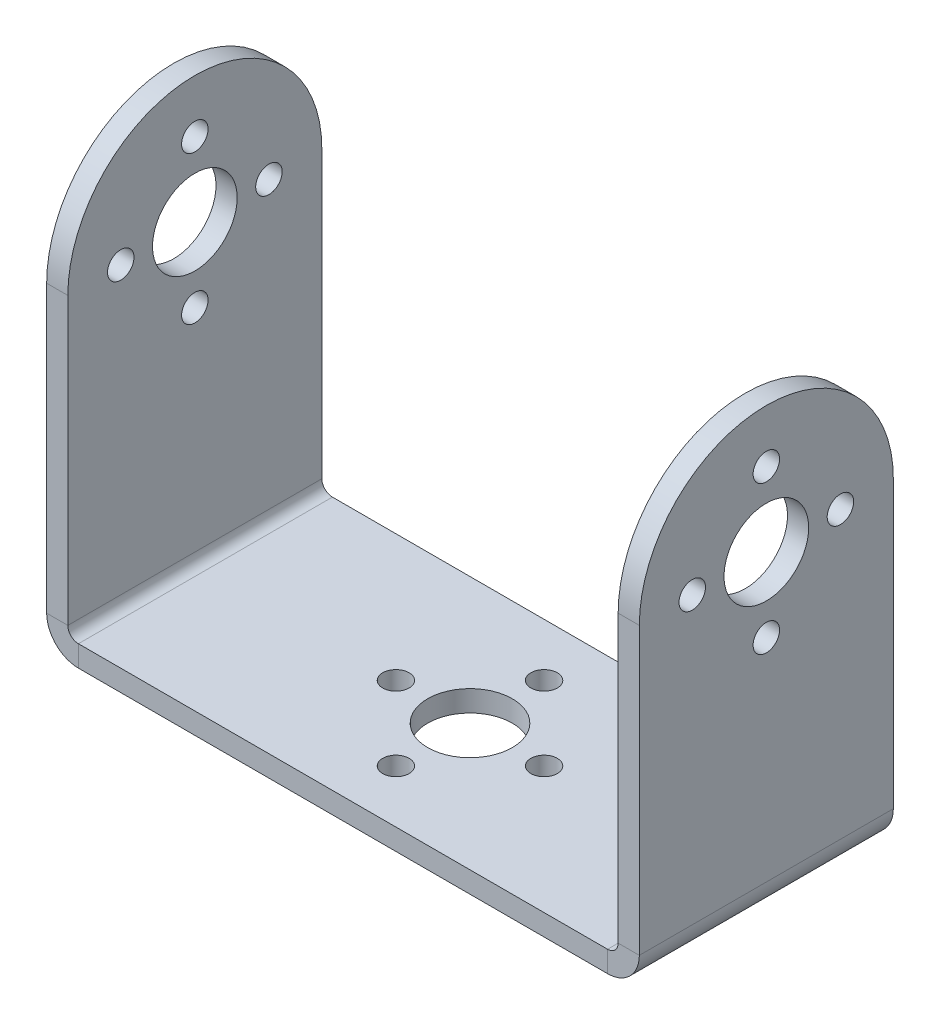
ISO-10303-21;
HEADER;
FILE_DESCRIPTION(('STEP AP214'),'2;1');
FILE_NAME('part.step','',(''),(''),'','','');
FILE_SCHEMA(('AUTOMOTIVE_DESIGN { 1 0 10303 214 1 1 1 1 }'));
ENDSEC;
DATA;
#1=APPLICATION_CONTEXT('core data for automotive mechanical design processes');
#2=APPLICATION_PROTOCOL_DEFINITION('international standard','automotive_design',2000,#1);
#3=PRODUCT_CONTEXT('',#1,'mechanical');
#4=PRODUCT('Part','Part','',(#3));
#5=PRODUCT_RELATED_PRODUCT_CATEGORY('part','',(#4));
#6=PRODUCT_DEFINITION_FORMATION('','',#4);
#7=PRODUCT_DEFINITION_CONTEXT('part definition',#1,'design');
#8=PRODUCT_DEFINITION('design','',#6,#7);
#9=PRODUCT_DEFINITION_SHAPE('','',#8);
#10=(LENGTH_UNIT() NAMED_UNIT(*) SI_UNIT(.MILLI.,.METRE.));
#11=(NAMED_UNIT(*) PLANE_ANGLE_UNIT() SI_UNIT($,.RADIAN.));
#12=(NAMED_UNIT(*) SI_UNIT($,.STERADIAN.) SOLID_ANGLE_UNIT());
#13=UNCERTAINTY_MEASURE_WITH_UNIT(LENGTH_MEASURE(1.E-05),#10,'distance_accuracy_value','');
#14=(GEOMETRIC_REPRESENTATION_CONTEXT(3) GLOBAL_UNCERTAINTY_ASSIGNED_CONTEXT((#13)) GLOBAL_UNIT_ASSIGNED_CONTEXT((#10,
#11,#12)) REPRESENTATION_CONTEXT('',''));
#15=CARTESIAN_POINT('',(0.,0.,0.));
#16=DIRECTION('',(0.,0.,1.));
#17=DIRECTION('',(1.,0.,0.));
#18=AXIS2_PLACEMENT_3D('',#15,#16,#17);
#19=CARTESIAN_POINT('',(28.,0.,12.));
#20=DIRECTION('',(-1.,0.,0.));
#21=DIRECTION('',(0.,-1.,0.));
#22=AXIS2_PLACEMENT_3D('',#19,#20,#21);
#23=PLANE('',#22);
#24=CARTESIAN_POINT('',(28.,37.,0.));
#25=DIRECTION('',(1.,0.,0.));
#26=DIRECTION('',(0.,0.,-1.));
#27=AXIS2_PLACEMENT_3D('',#24,#25,#26);
#28=CIRCLE('',#27,1.25);
#29=CARTESIAN_POINT('',(28.,37.,-1.25));
#30=VERTEX_POINT('',#29);
#31=EDGE_CURVE('E352',#30,#30,#28,.T.);
#32=ORIENTED_EDGE('',*,*,#31,.F.);
#33=EDGE_LOOP('',(#32));
#34=FACE_BOUND('',#33,.T.);
#35=CARTESIAN_POINT('',(28.,30.,-7.));
#36=DIRECTION('',(1.,0.,0.));
#37=DIRECTION('',(0.,0.,-1.));
#38=AXIS2_PLACEMENT_3D('',#35,#36,#37);
#39=CIRCLE('',#38,1.25);
#40=CARTESIAN_POINT('',(28.,30.,-8.25));
#41=VERTEX_POINT('',#40);
#42=EDGE_CURVE('E340',#41,#41,#39,.T.);
#43=ORIENTED_EDGE('',*,*,#42,.F.);
#44=EDGE_LOOP('',(#43));
#45=FACE_BOUND('',#44,.T.);
#46=CARTESIAN_POINT('',(28.,23.,0.));
#47=DIRECTION('',(1.,0.,0.));
#48=DIRECTION('',(0.,0.,-1.));
#49=AXIS2_PLACEMENT_3D('',#46,#47,#48);
#50=CIRCLE('',#49,1.25);
#51=CARTESIAN_POINT('',(28.,23.,-1.25));
#52=VERTEX_POINT('',#51);
#53=EDGE_CURVE('E328',#52,#52,#50,.T.);
#54=ORIENTED_EDGE('',*,*,#53,.F.);
#55=EDGE_LOOP('',(#54));
#56=FACE_BOUND('',#55,.T.);
#57=CARTESIAN_POINT('',(28.,30.,7.));
#58=DIRECTION('',(1.,0.,0.));
#59=DIRECTION('',(0.,0.,-1.));
#60=AXIS2_PLACEMENT_3D('',#57,#58,#59);
#61=CIRCLE('',#60,1.25);
#62=CARTESIAN_POINT('',(28.,30.,5.75));
#63=VERTEX_POINT('',#62);
#64=EDGE_CURVE('E316',#63,#63,#61,.T.);
#65=ORIENTED_EDGE('',*,*,#64,.F.);
#66=EDGE_LOOP('',(#65));
#67=FACE_BOUND('',#66,.T.);
#68=CARTESIAN_POINT('',(28.,30.,0.));
#69=DIRECTION('',(1.,0.,0.));
#70=DIRECTION('',(0.,0.,-1.));
#71=AXIS2_PLACEMENT_3D('',#68,#69,#70);
#72=CIRCLE('',#71,4.);
#73=CARTESIAN_POINT('',(28.,30.,-4.));
#74=VERTEX_POINT('',#73);
#75=EDGE_CURVE('E304',#74,#74,#72,.T.);
#76=ORIENTED_EDGE('',*,*,#75,.F.);
#77=EDGE_LOOP('',(#76));
#78=FACE_BOUND('',#77,.T.);
#79=DIRECTION('',(0.,1.,0.));
#80=VECTOR('',#79,1.);
#81=CARTESIAN_POINT('',(28.,0.,-12.));
#82=LINE('',#81,#80);
#83=CARTESIAN_POINT('',(28.,3.,-12.));
#84=VERTEX_POINT('',#83);
#85=CARTESIAN_POINT('',(28.,30.,-12.));
#86=VERTEX_POINT('',#85);
#87=EDGE_CURVE('E161',#84,#86,#82,.T.);
#88=ORIENTED_EDGE('',*,*,#87,.T.);
#89=CARTESIAN_POINT('',(28.,30.,0.));
#90=DIRECTION('',(-1.,0.,0.));
#91=DIRECTION('',(0.,-1.,0.));
#92=AXIS2_PLACEMENT_3D('',#89,#90,#91);
#93=CIRCLE('',#92,12.);
#94=CARTESIAN_POINT('',(28.,30.,12.));
#95=VERTEX_POINT('',#94);
#96=EDGE_CURVE('E269',#86,#95,#93,.F.);
#97=ORIENTED_EDGE('',*,*,#96,.T.);
#98=DIRECTION('',(0.,1.,0.));
#99=VECTOR('',#98,1.);
#100=CARTESIAN_POINT('',(28.,0.,12.));
#101=LINE('',#100,#99);
#102=CARTESIAN_POINT('',(28.,3.,12.));
#103=VERTEX_POINT('',#102);
#104=EDGE_CURVE('E185',#103,#95,#101,.T.);
#105=ORIENTED_EDGE('',*,*,#104,.F.);
#106=DIRECTION('',(0.,0.,-1.));
#107=VECTOR('',#106,1.);
#108=CARTESIAN_POINT('',(28.,3.,12.));
#109=LINE('',#108,#107);
#110=EDGE_CURVE('E157',#103,#84,#109,.T.);
#111=ORIENTED_EDGE('',*,*,#110,.T.);
#112=EDGE_LOOP('',(#88,#97,#105,#111));
#113=FACE_BOUND('',#112,.T.);
#114=ADVANCED_FACE('F36',(#34,#45,#56,#67,#78,#113),#23,.F.);
#115=CARTESIAN_POINT('',(26.,0.,12.));
#116=DIRECTION('',(-1.,0.,0.));
#117=DIRECTION('',(0.,-1.,0.));
#118=AXIS2_PLACEMENT_3D('',#115,#116,#117);
#119=PLANE('',#118);
#120=CARTESIAN_POINT('',(26.,37.,0.));
#121=DIRECTION('',(-1.,0.,0.));
#122=DIRECTION('',(0.,-1.,0.));
#123=AXIS2_PLACEMENT_3D('',#120,#121,#122);
#124=CIRCLE('',#123,1.25);
#125=CARTESIAN_POINT('',(26.,35.75,0.));
#126=VERTEX_POINT('',#125);
#127=EDGE_CURVE('E343',#126,#126,#124,.T.);
#128=ORIENTED_EDGE('',*,*,#127,.F.);
#129=EDGE_LOOP('',(#128));
#130=FACE_BOUND('',#129,.T.);
#131=CARTESIAN_POINT('',(26.,30.,-7.));
#132=DIRECTION('',(-1.,0.,0.));
#133=DIRECTION('',(0.,-1.,0.));
#134=AXIS2_PLACEMENT_3D('',#131,#132,#133);
#135=CIRCLE('',#134,1.25);
#136=CARTESIAN_POINT('',(26.,28.75,-7.));
#137=VERTEX_POINT('',#136);
#138=EDGE_CURVE('E334',#137,#137,#135,.T.);
#139=ORIENTED_EDGE('',*,*,#138,.F.);
#140=EDGE_LOOP('',(#139));
#141=FACE_BOUND('',#140,.T.);
#142=CARTESIAN_POINT('',(26.,23.,0.));
#143=DIRECTION('',(-1.,0.,0.));
#144=DIRECTION('',(0.,-1.,0.));
#145=AXIS2_PLACEMENT_3D('',#142,#143,#144);
#146=CIRCLE('',#145,1.25);
#147=CARTESIAN_POINT('',(26.,21.75,0.));
#148=VERTEX_POINT('',#147);
#149=EDGE_CURVE('E322',#148,#148,#146,.T.);
#150=ORIENTED_EDGE('',*,*,#149,.F.);
#151=EDGE_LOOP('',(#150));
#152=FACE_BOUND('',#151,.T.);
#153=CARTESIAN_POINT('',(26.,30.,7.));
#154=DIRECTION('',(-1.,0.,0.));
#155=DIRECTION('',(0.,-1.,0.));
#156=AXIS2_PLACEMENT_3D('',#153,#154,#155);
#157=CIRCLE('',#156,1.25);
#158=CARTESIAN_POINT('',(26.,28.75,7.));
#159=VERTEX_POINT('',#158);
#160=EDGE_CURVE('E307',#159,#159,#157,.T.);
#161=ORIENTED_EDGE('',*,*,#160,.F.);
#162=EDGE_LOOP('',(#161));
#163=FACE_BOUND('',#162,.T.);
#164=CARTESIAN_POINT('',(26.,30.,0.));
#165=DIRECTION('',(-1.,0.,0.));
#166=DIRECTION('',(0.,-1.,0.));
#167=AXIS2_PLACEMENT_3D('',#164,#165,#166);
#168=CIRCLE('',#167,4.);
#169=CARTESIAN_POINT('',(26.,26.,0.));
#170=VERTEX_POINT('',#169);
#171=EDGE_CURVE('E278',#170,#170,#168,.T.);
#172=ORIENTED_EDGE('',*,*,#171,.F.);
#173=EDGE_LOOP('',(#172));
#174=FACE_BOUND('',#173,.T.);
#175=CARTESIAN_POINT('',(26.,30.,0.));
#176=DIRECTION('',(-1.,0.,0.));
#177=DIRECTION('',(0.,-1.,0.));
#178=AXIS2_PLACEMENT_3D('',#175,#176,#177);
#179=CIRCLE('',#178,12.);
#180=CARTESIAN_POINT('',(26.,30.,-12.));
#181=VERTEX_POINT('',#180);
#182=CARTESIAN_POINT('',(26.,30.,12.));
#183=VERTEX_POINT('',#182);
#184=EDGE_CURVE('E51',#181,#183,#179,.F.);
#185=ORIENTED_EDGE('',*,*,#184,.F.);
#186=DIRECTION('',(0.,1.,0.));
#187=VECTOR('',#186,1.);
#188=CARTESIAN_POINT('',(26.,0.,-12.));
#189=LINE('',#188,#187);
#190=CARTESIAN_POINT('',(26.,3.,-12.));
#191=VERTEX_POINT('',#190);
#192=EDGE_CURVE('E164',#191,#181,#189,.T.);
#193=ORIENTED_EDGE('',*,*,#192,.F.);
#194=DIRECTION('',(0.,0.,-1.));
#195=VECTOR('',#194,1.);
#196=CARTESIAN_POINT('',(26.,3.,12.));
#197=LINE('',#196,#195);
#198=CARTESIAN_POINT('',(26.,3.,12.));
#199=VERTEX_POINT('',#198);
#200=EDGE_CURVE('E199',#199,#191,#197,.T.);
#201=ORIENTED_EDGE('',*,*,#200,.F.);
#202=DIRECTION('',(0.,1.,0.));
#203=VECTOR('',#202,1.);
#204=CARTESIAN_POINT('',(26.,0.,12.));
#205=LINE('',#204,#203);
#206=EDGE_CURVE('E267',#199,#183,#205,.T.);
#207=ORIENTED_EDGE('',*,*,#206,.T.);
#208=EDGE_LOOP('',(#185,#193,#201,#207));
#209=FACE_BOUND('',#208,.T.);
#210=ADVANCED_FACE('F266',(#130,#141,#152,#163,#174,#209),#119,.T.);
#211=CARTESIAN_POINT('',(-26.,42.,12.));
#212=DIRECTION('',(1.,0.,0.));
#213=DIRECTION('',(0.,1.,0.));
#214=AXIS2_PLACEMENT_3D('',#211,#212,#213);
#215=PLANE('',#214);
#216=CARTESIAN_POINT('',(-26.,37.,0.));
#217=DIRECTION('',(1.,0.,0.));
#218=DIRECTION('',(0.,1.,0.));
#219=AXIS2_PLACEMENT_3D('',#216,#217,#218);
#220=CIRCLE('',#219,1.25);
#221=CARTESIAN_POINT('',(-26.,38.25,0.));
#222=VERTEX_POINT('',#221);
#223=EDGE_CURVE('E346',#222,#222,#220,.T.);
#224=ORIENTED_EDGE('',*,*,#223,.F.);
#225=EDGE_LOOP('',(#224));
#226=FACE_BOUND('',#225,.T.);
#227=CARTESIAN_POINT('',(-26.,30.,-7.));
#228=DIRECTION('',(1.,0.,0.));
#229=DIRECTION('',(0.,1.,0.));
#230=AXIS2_PLACEMENT_3D('',#227,#228,#229);
#231=CIRCLE('',#230,1.25);
#232=CARTESIAN_POINT('',(-26.,31.25,-7.));
#233=VERTEX_POINT('',#232);
#234=EDGE_CURVE('E331',#233,#233,#231,.T.);
#235=ORIENTED_EDGE('',*,*,#234,.F.);
#236=EDGE_LOOP('',(#235));
#237=FACE_BOUND('',#236,.T.);
#238=CARTESIAN_POINT('',(-26.,23.,0.));
#239=DIRECTION('',(1.,0.,0.));
#240=DIRECTION('',(0.,1.,0.));
#241=AXIS2_PLACEMENT_3D('',#238,#239,#240);
#242=CIRCLE('',#241,1.25);
#243=CARTESIAN_POINT('',(-26.,24.25,0.));
#244=VERTEX_POINT('',#243);
#245=EDGE_CURVE('E319',#244,#244,#242,.T.);
#246=ORIENTED_EDGE('',*,*,#245,.F.);
#247=EDGE_LOOP('',(#246));
#248=FACE_BOUND('',#247,.T.);
#249=CARTESIAN_POINT('',(-26.,30.,7.));
#250=DIRECTION('',(1.,0.,0.));
#251=DIRECTION('',(0.,1.,0.));
#252=AXIS2_PLACEMENT_3D('',#249,#250,#251);
#253=CIRCLE('',#252,1.25);
#254=CARTESIAN_POINT('',(-26.,31.25,7.));
#255=VERTEX_POINT('',#254);
#256=EDGE_CURVE('E310',#255,#255,#253,.T.);
#257=ORIENTED_EDGE('',*,*,#256,.F.);
#258=EDGE_LOOP('',(#257));
#259=FACE_BOUND('',#258,.T.);
#260=CARTESIAN_POINT('',(-26.,30.,0.));
#261=DIRECTION('',(1.,0.,0.));
#262=DIRECTION('',(0.,1.,0.));
#263=AXIS2_PLACEMENT_3D('',#260,#261,#262);
#264=CIRCLE('',#263,4.);
#265=CARTESIAN_POINT('',(-26.,34.,0.));
#266=VERTEX_POINT('',#265);
#267=EDGE_CURVE('E298',#266,#266,#264,.T.);
#268=ORIENTED_EDGE('',*,*,#267,.F.);
#269=EDGE_LOOP('',(#268));
#270=FACE_BOUND('',#269,.T.);
#271=DIRECTION('',(0.,-1.,0.));
#272=VECTOR('',#271,1.);
#273=CARTESIAN_POINT('',(-26.,42.,-12.));
#274=LINE('',#273,#272);
#275=CARTESIAN_POINT('',(-26.,30.,-12.));
#276=VERTEX_POINT('',#275);
#277=CARTESIAN_POINT('',(-26.,3.00000000000002,-12.));
#278=VERTEX_POINT('',#277);
#279=EDGE_CURVE('E176',#276,#278,#274,.T.);
#280=ORIENTED_EDGE('',*,*,#279,.F.);
#281=CARTESIAN_POINT('',(-26.,30.,0.));
#282=DIRECTION('',(1.,0.,0.));
#283=DIRECTION('',(0.,1.,0.));
#284=AXIS2_PLACEMENT_3D('',#281,#282,#283);
#285=CIRCLE('',#284,12.);
#286=CARTESIAN_POINT('',(-26.,30.,12.));
#287=VERTEX_POINT('',#286);
#288=EDGE_CURVE('E289',#287,#276,#285,.F.);
#289=ORIENTED_EDGE('',*,*,#288,.F.);
#290=DIRECTION('',(0.,-1.,0.));
#291=VECTOR('',#290,1.);
#292=CARTESIAN_POINT('',(-26.,42.,12.));
#293=LINE('',#292,#291);
#294=CARTESIAN_POINT('',(-26.,3.00000000000002,12.));
#295=VERTEX_POINT('',#294);
#296=EDGE_CURVE('E234',#287,#295,#293,.T.);
#297=ORIENTED_EDGE('',*,*,#296,.T.);
#298=DIRECTION('',(0.,0.,-1.));
#299=VECTOR('',#298,1.);
#300=CARTESIAN_POINT('',(-26.,3.00000000000002,12.));
#301=LINE('',#300,#299);
#302=EDGE_CURVE('E190',#295,#278,#301,.T.);
#303=ORIENTED_EDGE('',*,*,#302,.T.);
#304=EDGE_LOOP('',(#280,#289,#297,#303));
#305=FACE_BOUND('',#304,.T.);
#306=ADVANCED_FACE('F230',(#226,#237,#248,#259,#270,#305),#215,.T.);
#307=CARTESIAN_POINT('',(-28.,42.,12.));
#308=DIRECTION('',(1.,0.,0.));
#309=DIRECTION('',(0.,1.,0.));
#310=AXIS2_PLACEMENT_3D('',#307,#308,#309);
#311=PLANE('',#310);
#312=CARTESIAN_POINT('',(-28.,37.,0.));
#313=DIRECTION('',(1.,0.,0.));
#314=DIRECTION('',(0.,0.,-1.));
#315=AXIS2_PLACEMENT_3D('',#312,#313,#314);
#316=CIRCLE('',#315,1.24999999999999);
#317=CARTESIAN_POINT('',(-28.,37.,-1.24999999999999));
#318=VERTEX_POINT('',#317);
#319=EDGE_CURVE('E349',#318,#318,#316,.T.);
#320=ORIENTED_EDGE('',*,*,#319,.T.);
#321=EDGE_LOOP('',(#320));
#322=FACE_BOUND('',#321,.T.);
#323=CARTESIAN_POINT('',(-28.,30.,-7.));
#324=DIRECTION('',(1.,0.,0.));
#325=DIRECTION('',(0.,0.,-1.));
#326=AXIS2_PLACEMENT_3D('',#323,#324,#325);
#327=CIRCLE('',#326,1.24999999999999);
#328=CARTESIAN_POINT('',(-28.,30.,-8.24999999999999));
#329=VERTEX_POINT('',#328);
#330=EDGE_CURVE('E337',#329,#329,#327,.T.);
#331=ORIENTED_EDGE('',*,*,#330,.T.);
#332=EDGE_LOOP('',(#331));
#333=FACE_BOUND('',#332,.T.);
#334=CARTESIAN_POINT('',(-28.,23.,0.));
#335=DIRECTION('',(1.,0.,0.));
#336=DIRECTION('',(0.,0.,-1.));
#337=AXIS2_PLACEMENT_3D('',#334,#335,#336);
#338=CIRCLE('',#337,1.24999999999999);
#339=CARTESIAN_POINT('',(-28.,23.,-1.24999999999999));
#340=VERTEX_POINT('',#339);
#341=EDGE_CURVE('E325',#340,#340,#338,.T.);
#342=ORIENTED_EDGE('',*,*,#341,.T.);
#343=EDGE_LOOP('',(#342));
#344=FACE_BOUND('',#343,.T.);
#345=CARTESIAN_POINT('',(-28.,30.,7.));
#346=DIRECTION('',(1.,0.,0.));
#347=DIRECTION('',(0.,0.,-1.));
#348=AXIS2_PLACEMENT_3D('',#345,#346,#347);
#349=CIRCLE('',#348,1.24999999999999);
#350=CARTESIAN_POINT('',(-28.,30.,5.75000000000001));
#351=VERTEX_POINT('',#350);
#352=EDGE_CURVE('E313',#351,#351,#349,.T.);
#353=ORIENTED_EDGE('',*,*,#352,.T.);
#354=EDGE_LOOP('',(#353));
#355=FACE_BOUND('',#354,.T.);
#356=CARTESIAN_POINT('',(-28.,30.,0.));
#357=DIRECTION('',(1.,0.,0.));
#358=DIRECTION('',(0.,0.,-1.));
#359=AXIS2_PLACEMENT_3D('',#356,#357,#358);
#360=CIRCLE('',#359,3.99999999999999);
#361=CARTESIAN_POINT('',(-28.,30.,-3.99999999999999));
#362=VERTEX_POINT('',#361);
#363=EDGE_CURVE('E301',#362,#362,#360,.T.);
#364=ORIENTED_EDGE('',*,*,#363,.T.);
#365=EDGE_LOOP('',(#364));
#366=FACE_BOUND('',#365,.T.);
#367=CARTESIAN_POINT('',(-28.,30.,0.));
#368=DIRECTION('',(1.,0.,0.));
#369=DIRECTION('',(0.,1.,0.));
#370=AXIS2_PLACEMENT_3D('',#367,#368,#369);
#371=CIRCLE('',#370,12.);
#372=CARTESIAN_POINT('',(-28.,30.,12.));
#373=VERTEX_POINT('',#372);
#374=CARTESIAN_POINT('',(-28.,30.,-12.));
#375=VERTEX_POINT('',#374);
#376=EDGE_CURVE('E250',#373,#375,#371,.F.);
#377=ORIENTED_EDGE('',*,*,#376,.T.);
#378=DIRECTION('',(0.,-1.,0.));
#379=VECTOR('',#378,1.);
#380=CARTESIAN_POINT('',(-28.,42.,-12.));
#381=LINE('',#380,#379);
#382=CARTESIAN_POINT('',(-28.,3.00000000000004,-12.));
#383=VERTEX_POINT('',#382);
#384=EDGE_CURVE('E178',#375,#383,#381,.T.);
#385=ORIENTED_EDGE('',*,*,#384,.T.);
#386=DIRECTION('',(0.,0.,-1.));
#387=VECTOR('',#386,1.);
#388=CARTESIAN_POINT('',(-28.,3.00000000000004,12.));
#389=LINE('',#388,#387);
#390=CARTESIAN_POINT('',(-28.,3.00000000000004,12.));
#391=VERTEX_POINT('',#390);
#392=EDGE_CURVE('E149',#391,#383,#389,.T.);
#393=ORIENTED_EDGE('',*,*,#392,.F.);
#394=DIRECTION('',(0.,-1.,0.));
#395=VECTOR('',#394,1.);
#396=CARTESIAN_POINT('',(-28.,42.,12.));
#397=LINE('',#396,#395);
#398=EDGE_CURVE('E138',#373,#391,#397,.T.);
#399=ORIENTED_EDGE('',*,*,#398,.F.);
#400=EDGE_LOOP('',(#377,#385,#393,#399));
#401=FACE_BOUND('',#400,.T.);
#402=ADVANCED_FACE('F247',(#322,#333,#344,#355,#366,#401),#311,.F.);
#403=CARTESIAN_POINT('',(25.,3.,12.));
#404=DIRECTION('',(0.,0.,1.));
#405=DIRECTION('',(1.,0.,0.));
#406=AXIS2_PLACEMENT_3D('',#403,#404,#405);
#407=PLANE('',#406);
#408=ORIENTED_EDGE('',*,*,#104,.T.);
#409=DIRECTION('',(1.,0.,0.));
#410=VECTOR('',#409,1.);
#411=CARTESIAN_POINT('',(28.,30.,12.));
#412=LINE('',#411,#410);
#413=EDGE_CURVE('E268',#95,#183,#412,.F.);
#414=ORIENTED_EDGE('',*,*,#413,.T.);
#415=ORIENTED_EDGE('',*,*,#206,.F.);
#416=DIRECTION('',(1.,0.,0.));
#417=VECTOR('',#416,1.);
#418=CARTESIAN_POINT('',(26.,3.,12.));
#419=LINE('',#418,#417);
#420=EDGE_CURVE('E60',#199,#103,#419,.T.);
#421=ORIENTED_EDGE('',*,*,#420,.T.);
#422=EDGE_LOOP('',(#408,#414,#415,#421));
#423=FACE_BOUND('',#422,.T.);
#424=ADVANCED_FACE('F284',(#423),#407,.T.);
#425=CARTESIAN_POINT('',(-28.,3.00000000000004,12.));
#426=DIRECTION('',(0.,0.,1.));
#427=DIRECTION('',(1.,0.,0.));
#428=AXIS2_PLACEMENT_3D('',#425,#426,#427);
#429=PLANE('',#428);
#430=DIRECTION('',(1.,0.,0.));
#431=VECTOR('',#430,1.);
#432=CARTESIAN_POINT('',(-28.,3.00000000000004,12.));
#433=LINE('',#432,#431);
#434=EDGE_CURVE('E11',#391,#295,#433,.T.);
#435=ORIENTED_EDGE('',*,*,#434,.F.);
#436=CARTESIAN_POINT('',(-25.,3.00000000000001,12.));
#437=DIRECTION('',(0.,0.,-1.));
#438=DIRECTION('',(-1.,0.,0.));
#439=AXIS2_PLACEMENT_3D('',#436,#437,#438);
#440=CIRCLE('',#439,3.);
#441=CARTESIAN_POINT('',(-25.,0.,12.));
#442=VERTEX_POINT('',#441);
#443=EDGE_CURVE('E133',#391,#442,#440,.F.);
#444=ORIENTED_EDGE('',*,*,#443,.T.);
#445=DIRECTION('',(0.,-1.,0.));
#446=VECTOR('',#445,1.);
#447=CARTESIAN_POINT('',(-25.,2.,12.));
#448=LINE('',#447,#446);
#449=CARTESIAN_POINT('',(-25.,2.,12.));
#450=VERTEX_POINT('',#449);
#451=EDGE_CURVE('E44',#450,#442,#448,.T.);
#452=ORIENTED_EDGE('',*,*,#451,.F.);
#453=CARTESIAN_POINT('',(-25.,3.00000000000001,12.));
#454=DIRECTION('',(0.,0.,1.));
#455=DIRECTION('',(1.,0.,0.));
#456=AXIS2_PLACEMENT_3D('',#453,#454,#455);
#457=CIRCLE('',#456,1.);
#458=EDGE_CURVE('E219',#295,#450,#457,.T.);
#459=ORIENTED_EDGE('',*,*,#458,.F.);
#460=EDGE_LOOP('',(#435,#444,#452,#459));
#461=FACE_BOUND('',#460,.T.);
#462=ADVANCED_FACE('F38',(#461),#429,.T.);
#463=CARTESIAN_POINT('',(-25.,2.,12.));
#464=DIRECTION('',(0.,0.,1.));
#465=DIRECTION('',(1.,0.,0.));
#466=AXIS2_PLACEMENT_3D('',#463,#464,#465);
#467=PLANE('',#466);
#468=DIRECTION('',(1.,0.,0.));
#469=VECTOR('',#468,1.);
#470=CARTESIAN_POINT('',(-26.,30.,12.));
#471=LINE('',#470,#469);
#472=EDGE_CURVE('E165',#287,#373,#471,.F.);
#473=ORIENTED_EDGE('',*,*,#472,.T.);
#474=ORIENTED_EDGE('',*,*,#398,.T.);
#475=ORIENTED_EDGE('',*,*,#434,.T.);
#476=ORIENTED_EDGE('',*,*,#296,.F.);
#477=EDGE_LOOP('',(#473,#474,#475,#476));
#478=FACE_BOUND('',#477,.T.);
#479=ADVANCED_FACE('F243',(#478),#467,.T.);
#480=CARTESIAN_POINT('',(-25.,0.,-12.));
#481=DIRECTION('',(0.,0.,-1.));
#482=DIRECTION('',(-1.,0.,0.));
#483=AXIS2_PLACEMENT_3D('',#480,#481,#482);
#484=PLANE('',#483);
#485=DIRECTION('',(0.,1.,0.));
#486=VECTOR('',#485,1.);
#487=CARTESIAN_POINT('',(-25.,0.,-12.));
#488=LINE('',#487,#486);
#489=CARTESIAN_POINT('',(-25.,0.,-12.));
#490=VERTEX_POINT('',#489);
#491=CARTESIAN_POINT('',(-25.,2.,-12.));
#492=VERTEX_POINT('',#491);
#493=EDGE_CURVE('E130',#490,#492,#488,.T.);
#494=ORIENTED_EDGE('',*,*,#493,.F.);
#495=CARTESIAN_POINT('',(-25.,3.00000000000001,-12.));
#496=DIRECTION('',(0.,0.,-1.));
#497=DIRECTION('',(-1.,0.,0.));
#498=AXIS2_PLACEMENT_3D('',#495,#496,#497);
#499=CIRCLE('',#498,3.);
#500=EDGE_CURVE('E145',#383,#490,#499,.F.);
#501=ORIENTED_EDGE('',*,*,#500,.F.);
#502=DIRECTION('',(-1.,0.,0.));
#503=VECTOR('',#502,1.);
#504=CARTESIAN_POINT('',(-26.,3.00000000000002,-12.));
#505=LINE('',#504,#503);
#506=EDGE_CURVE('E208',#278,#383,#505,.T.);
#507=ORIENTED_EDGE('',*,*,#506,.F.);
#508=CARTESIAN_POINT('',(-25.,3.00000000000001,-12.));
#509=DIRECTION('',(0.,0.,1.));
#510=DIRECTION('',(1.,0.,0.));
#511=AXIS2_PLACEMENT_3D('',#508,#509,#510);
#512=CIRCLE('',#511,1.);
#513=EDGE_CURVE('E173',#278,#492,#512,.T.);
#514=ORIENTED_EDGE('',*,*,#513,.T.);
#515=EDGE_LOOP('',(#494,#501,#507,#514));
#516=FACE_BOUND('',#515,.T.);
#517=ADVANCED_FACE('F225',(#516),#484,.T.);
#518=CARTESIAN_POINT('',(-26.,3.00000000000002,-12.));
#519=DIRECTION('',(0.,0.,-1.));
#520=DIRECTION('',(-1.,0.,0.));
#521=AXIS2_PLACEMENT_3D('',#518,#519,#520);
#522=PLANE('',#521);
#523=DIRECTION('',(1.,0.,0.));
#524=VECTOR('',#523,1.);
#525=CARTESIAN_POINT('',(-28.,0.,-12.));
#526=LINE('',#525,#524);
#527=CARTESIAN_POINT('',(25.,0.,-12.));
#528=VERTEX_POINT('',#527);
#529=EDGE_CURVE('E181',#490,#528,#526,.T.);
#530=ORIENTED_EDGE('',*,*,#529,.F.);
#531=ORIENTED_EDGE('',*,*,#493,.T.);
#532=DIRECTION('',(1.,0.,0.));
#533=VECTOR('',#532,1.);
#534=CARTESIAN_POINT('',(-28.,2.,-12.));
#535=LINE('',#534,#533);
#536=CARTESIAN_POINT('',(25.,2.,-12.));
#537=VERTEX_POINT('',#536);
#538=EDGE_CURVE('E170',#492,#537,#535,.T.);
#539=ORIENTED_EDGE('',*,*,#538,.T.);
#540=DIRECTION('',(0.,-1.,0.));
#541=VECTOR('',#540,1.);
#542=CARTESIAN_POINT('',(25.,2.,-12.));
#543=LINE('',#542,#541);
#544=EDGE_CURVE('E202',#537,#528,#543,.T.);
#545=ORIENTED_EDGE('',*,*,#544,.T.);
#546=EDGE_LOOP('',(#530,#531,#539,#545));
#547=FACE_BOUND('',#546,.T.);
#548=ADVANCED_FACE('F212',(#547),#522,.T.);
#549=CARTESIAN_POINT('',(25.,0.,12.));
#550=DIRECTION('',(0.,0.,1.));
#551=DIRECTION('',(1.,0.,0.));
#552=AXIS2_PLACEMENT_3D('',#549,#550,#551);
#553=PLANE('',#552);
#554=DIRECTION('',(0.,1.,0.));
#555=VECTOR('',#554,1.);
#556=CARTESIAN_POINT('',(25.,0.,12.));
#557=LINE('',#556,#555);
#558=CARTESIAN_POINT('',(25.,0.,12.));
#559=VERTEX_POINT('',#558);
#560=CARTESIAN_POINT('',(25.,2.,12.));
#561=VERTEX_POINT('',#560);
#562=EDGE_CURVE('E206',#559,#561,#557,.T.);
#563=ORIENTED_EDGE('',*,*,#562,.F.);
#564=CARTESIAN_POINT('',(25.,3.,12.));
#565=DIRECTION('',(0.,0.,-1.));
#566=DIRECTION('',(-1.,0.,0.));
#567=AXIS2_PLACEMENT_3D('',#564,#565,#566);
#568=CIRCLE('',#567,3.);
#569=EDGE_CURVE('E155',#559,#103,#568,.F.);
#570=ORIENTED_EDGE('',*,*,#569,.T.);
#571=ORIENTED_EDGE('',*,*,#420,.F.);
#572=CARTESIAN_POINT('',(25.,3.,12.));
#573=DIRECTION('',(0.,0.,1.));
#574=DIRECTION('',(1.,0.,0.));
#575=AXIS2_PLACEMENT_3D('',#572,#573,#574);
#576=CIRCLE('',#575,1.);
#577=EDGE_CURVE('E237',#561,#199,#576,.T.);
#578=ORIENTED_EDGE('',*,*,#577,.F.);
#579=EDGE_LOOP('',(#563,#570,#571,#578));
#580=FACE_BOUND('',#579,.T.);
#581=ADVANCED_FACE('F435',(#580),#553,.T.);
#582=CARTESIAN_POINT('',(26.,3.,12.));
#583=DIRECTION('',(0.,0.,1.));
#584=DIRECTION('',(1.,0.,0.));
#585=AXIS2_PLACEMENT_3D('',#582,#583,#584);
#586=PLANE('',#585);
#587=DIRECTION('',(1.,0.,0.));
#588=VECTOR('',#587,1.);
#589=CARTESIAN_POINT('',(-28.,0.,12.));
#590=LINE('',#589,#588);
#591=EDGE_CURVE('E122',#442,#559,#590,.T.);
#592=ORIENTED_EDGE('',*,*,#591,.T.);
#593=ORIENTED_EDGE('',*,*,#562,.T.);
#594=DIRECTION('',(1.,0.,0.));
#595=VECTOR('',#594,1.);
#596=CARTESIAN_POINT('',(-28.,2.,12.));
#597=LINE('',#596,#595);
#598=EDGE_CURVE('E125',#450,#561,#597,.T.);
#599=ORIENTED_EDGE('',*,*,#598,.F.);
#600=ORIENTED_EDGE('',*,*,#451,.T.);
#601=EDGE_LOOP('',(#592,#593,#599,#600));
#602=FACE_BOUND('',#601,.T.);
#603=ADVANCED_FACE('F120',(#602),#586,.T.);
#604=CARTESIAN_POINT('',(28.,3.,-12.));
#605=DIRECTION('',(0.,0.,-1.));
#606=DIRECTION('',(-1.,0.,0.));
#607=AXIS2_PLACEMENT_3D('',#604,#605,#606);
#608=PLANE('',#607);
#609=DIRECTION('',(-1.,0.,0.));
#610=VECTOR('',#609,1.);
#611=CARTESIAN_POINT('',(28.,3.,-12.));
#612=LINE('',#611,#610);
#613=EDGE_CURVE('E94',#84,#191,#612,.T.);
#614=ORIENTED_EDGE('',*,*,#613,.F.);
#615=CARTESIAN_POINT('',(25.,3.,-12.));
#616=DIRECTION('',(0.,0.,-1.));
#617=DIRECTION('',(-1.,0.,0.));
#618=AXIS2_PLACEMENT_3D('',#615,#616,#617);
#619=CIRCLE('',#618,3.);
#620=EDGE_CURVE('E183',#528,#84,#619,.F.);
#621=ORIENTED_EDGE('',*,*,#620,.F.);
#622=ORIENTED_EDGE('',*,*,#544,.F.);
#623=CARTESIAN_POINT('',(25.,3.,-12.));
#624=DIRECTION('',(0.,0.,1.));
#625=DIRECTION('',(1.,0.,0.));
#626=AXIS2_PLACEMENT_3D('',#623,#624,#625);
#627=CIRCLE('',#626,1.);
#628=EDGE_CURVE('E168',#537,#191,#627,.T.);
#629=ORIENTED_EDGE('',*,*,#628,.T.);
#630=EDGE_LOOP('',(#614,#621,#622,#629));
#631=FACE_BOUND('',#630,.T.);
#632=ADVANCED_FACE('F430',(#631),#608,.T.);
#633=CARTESIAN_POINT('',(25.,2.,-12.));
#634=DIRECTION('',(0.,0.,-1.));
#635=DIRECTION('',(-1.,0.,0.));
#636=AXIS2_PLACEMENT_3D('',#633,#634,#635);
#637=PLANE('',#636);
#638=DIRECTION('',(-1.,0.,0.));
#639=VECTOR('',#638,1.);
#640=CARTESIAN_POINT('',(26.,30.,-12.));
#641=LINE('',#640,#639);
#642=EDGE_CURVE('E272',#181,#86,#641,.F.);
#643=ORIENTED_EDGE('',*,*,#642,.T.);
#644=ORIENTED_EDGE('',*,*,#87,.F.);
#645=ORIENTED_EDGE('',*,*,#613,.T.);
#646=ORIENTED_EDGE('',*,*,#192,.T.);
#647=EDGE_LOOP('',(#643,#644,#645,#646));
#648=FACE_BOUND('',#647,.T.);
#649=ADVANCED_FACE('F280',(#648),#637,.T.);
#650=CARTESIAN_POINT('',(25.,3.,12.));
#651=DIRECTION('',(0.,0.,-1.));
#652=DIRECTION('',(-1.,0.,0.));
#653=AXIS2_PLACEMENT_3D('',#650,#651,#652);
#654=CYLINDRICAL_SURFACE('',#653,1.);
#655=ORIENTED_EDGE('',*,*,#628,.F.);
#656=DIRECTION('',(0.,0.,-1.));
#657=VECTOR('',#656,1.);
#658=CARTESIAN_POINT('',(25.,2.,12.));
#659=LINE('',#658,#657);
#660=EDGE_CURVE('E196',#561,#537,#659,.T.);
#661=ORIENTED_EDGE('',*,*,#660,.F.);
#662=ORIENTED_EDGE('',*,*,#577,.T.);
#663=ORIENTED_EDGE('',*,*,#200,.T.);
#664=EDGE_LOOP('',(#655,#661,#662,#663));
#665=FACE_BOUND('',#664,.T.);
#666=ADVANCED_FACE('F283',(#665),#654,.F.);
#667=CARTESIAN_POINT('',(-28.,2.,12.));
#668=DIRECTION('',(0.,1.,0.));
#669=DIRECTION('',(0.,0.,1.));
#670=AXIS2_PLACEMENT_3D('',#667,#668,#669);
#671=PLANE('',#670);
#672=CARTESIAN_POINT('',(0.,2.,-7.));
#673=DIRECTION('',(0.,1.,0.));
#674=DIRECTION('',(0.,0.,1.));
#675=AXIS2_PLACEMENT_3D('',#672,#673,#674);
#676=CIRCLE('',#675,1.25);
#677=CARTESIAN_POINT('',(0.,2.,-5.75));
#678=VERTEX_POINT('',#677);
#679=EDGE_CURVE('E382',#678,#678,#676,.T.);
#680=ORIENTED_EDGE('',*,*,#679,.F.);
#681=EDGE_LOOP('',(#680));
#682=FACE_BOUND('',#681,.T.);
#683=CARTESIAN_POINT('',(7.,2.,0.));
#684=DIRECTION('',(0.,1.,0.));
#685=DIRECTION('',(0.,0.,1.));
#686=AXIS2_PLACEMENT_3D('',#683,#684,#685);
#687=CIRCLE('',#686,1.25);
#688=CARTESIAN_POINT('',(7.,2.,1.25));
#689=VERTEX_POINT('',#688);
#690=EDGE_CURVE('E376',#689,#689,#687,.T.);
#691=ORIENTED_EDGE('',*,*,#690,.F.);
#692=EDGE_LOOP('',(#691));
#693=FACE_BOUND('',#692,.T.);
#694=CARTESIAN_POINT('',(0.,2.,7.));
#695=DIRECTION('',(0.,1.,0.));
#696=DIRECTION('',(0.,0.,1.));
#697=AXIS2_PLACEMENT_3D('',#694,#695,#696);
#698=CIRCLE('',#697,1.25);
#699=CARTESIAN_POINT('',(0.,2.,8.25));
#700=VERTEX_POINT('',#699);
#701=EDGE_CURVE('E370',#700,#700,#698,.T.);
#702=ORIENTED_EDGE('',*,*,#701,.F.);
#703=EDGE_LOOP('',(#702));
#704=FACE_BOUND('',#703,.T.);
#705=CARTESIAN_POINT('',(-7.,2.,0.));
#706=DIRECTION('',(0.,1.,0.));
#707=DIRECTION('',(0.,0.,1.));
#708=AXIS2_PLACEMENT_3D('',#705,#706,#707);
#709=CIRCLE('',#708,1.25);
#710=CARTESIAN_POINT('',(-7.,2.,1.25));
#711=VERTEX_POINT('',#710);
#712=EDGE_CURVE('E364',#711,#711,#709,.T.);
#713=ORIENTED_EDGE('',*,*,#712,.F.);
#714=EDGE_LOOP('',(#713));
#715=FACE_BOUND('',#714,.T.);
#716=CARTESIAN_POINT('',(0.,2.,0.));
#717=DIRECTION('',(0.,1.,0.));
#718=DIRECTION('',(0.,0.,1.));
#719=AXIS2_PLACEMENT_3D('',#716,#717,#718);
#720=CIRCLE('',#719,4.);
#721=CARTESIAN_POINT('',(0.,2.,4.));
#722=VERTEX_POINT('',#721);
#723=EDGE_CURVE('E358',#722,#722,#720,.T.);
#724=ORIENTED_EDGE('',*,*,#723,.F.);
#725=EDGE_LOOP('',(#724));
#726=FACE_BOUND('',#725,.T.);
#727=ORIENTED_EDGE('',*,*,#538,.F.);
#728=DIRECTION('',(0.,0.,-1.));
#729=VECTOR('',#728,1.);
#730=CARTESIAN_POINT('',(-25.,2.,12.));
#731=LINE('',#730,#729);
#732=EDGE_CURVE('E193',#450,#492,#731,.T.);
#733=ORIENTED_EDGE('',*,*,#732,.F.);
#734=ORIENTED_EDGE('',*,*,#598,.T.);
#735=ORIENTED_EDGE('',*,*,#660,.T.);
#736=EDGE_LOOP('',(#727,#733,#734,#735));
#737=FACE_BOUND('',#736,.T.);
#738=ADVANCED_FACE('F221',(#682,#693,#704,#715,#726,#737),#671,.T.);
#739=CARTESIAN_POINT('',(-25.,3.00000000000001,12.));
#740=DIRECTION('',(0.,0.,-1.));
#741=DIRECTION('',(-1.,0.,0.));
#742=AXIS2_PLACEMENT_3D('',#739,#740,#741);
#743=CYLINDRICAL_SURFACE('',#742,1.);
#744=ORIENTED_EDGE('',*,*,#513,.F.);
#745=ORIENTED_EDGE('',*,*,#302,.F.);
#746=ORIENTED_EDGE('',*,*,#458,.T.);
#747=ORIENTED_EDGE('',*,*,#732,.T.);
#748=EDGE_LOOP('',(#744,#745,#746,#747));
#749=FACE_BOUND('',#748,.T.);
#750=ADVANCED_FACE('F217',(#749),#743,.F.);
#751=CARTESIAN_POINT('',(-25.,3.00000000000001,12.));
#752=DIRECTION('',(0.,0.,-1.));
#753=DIRECTION('',(-1.,0.,0.));
#754=AXIS2_PLACEMENT_3D('',#751,#752,#753);
#755=CYLINDRICAL_SURFACE('',#754,3.);
#756=ORIENTED_EDGE('',*,*,#500,.T.);
#757=DIRECTION('',(0.,0.,-1.));
#758=VECTOR('',#757,1.);
#759=CARTESIAN_POINT('',(-25.,0.,12.));
#760=LINE('',#759,#758);
#761=EDGE_CURVE('E142',#442,#490,#760,.T.);
#762=ORIENTED_EDGE('',*,*,#761,.F.);
#763=ORIENTED_EDGE('',*,*,#443,.F.);
#764=ORIENTED_EDGE('',*,*,#392,.T.);
#765=EDGE_LOOP('',(#756,#762,#763,#764));
#766=FACE_BOUND('',#765,.T.);
#767=ADVANCED_FACE('F143',(#766),#755,.T.);
#768=CARTESIAN_POINT('',(-28.,0.,12.));
#769=DIRECTION('',(0.,1.,0.));
#770=DIRECTION('',(0.,0.,1.));
#771=AXIS2_PLACEMENT_3D('',#768,#769,#770);
#772=PLANE('',#771);
#773=CARTESIAN_POINT('',(0.,0.,-7.));
#774=DIRECTION('',(0.,1.,0.));
#775=DIRECTION('',(0.,0.,1.));
#776=AXIS2_PLACEMENT_3D('',#773,#774,#775);
#777=CIRCLE('',#776,1.25);
#778=CARTESIAN_POINT('',(0.,0.,-5.75));
#779=VERTEX_POINT('',#778);
#780=EDGE_CURVE('E379',#779,#779,#777,.T.);
#781=ORIENTED_EDGE('',*,*,#780,.T.);
#782=EDGE_LOOP('',(#781));
#783=FACE_BOUND('',#782,.T.);
#784=CARTESIAN_POINT('',(7.,0.,0.));
#785=DIRECTION('',(0.,1.,0.));
#786=DIRECTION('',(0.,0.,1.));
#787=AXIS2_PLACEMENT_3D('',#784,#785,#786);
#788=CIRCLE('',#787,1.25);
#789=CARTESIAN_POINT('',(7.,0.,1.25));
#790=VERTEX_POINT('',#789);
#791=EDGE_CURVE('E373',#790,#790,#788,.T.);
#792=ORIENTED_EDGE('',*,*,#791,.T.);
#793=EDGE_LOOP('',(#792));
#794=FACE_BOUND('',#793,.T.);
#795=CARTESIAN_POINT('',(0.,0.,7.));
#796=DIRECTION('',(0.,1.,0.));
#797=DIRECTION('',(0.,0.,1.));
#798=AXIS2_PLACEMENT_3D('',#795,#796,#797);
#799=CIRCLE('',#798,1.25);
#800=CARTESIAN_POINT('',(0.,0.,8.25));
#801=VERTEX_POINT('',#800);
#802=EDGE_CURVE('E367',#801,#801,#799,.T.);
#803=ORIENTED_EDGE('',*,*,#802,.T.);
#804=EDGE_LOOP('',(#803));
#805=FACE_BOUND('',#804,.T.);
#806=CARTESIAN_POINT('',(-7.,0.,0.));
#807=DIRECTION('',(0.,1.,0.));
#808=DIRECTION('',(0.,0.,1.));
#809=AXIS2_PLACEMENT_3D('',#806,#807,#808);
#810=CIRCLE('',#809,1.25);
#811=CARTESIAN_POINT('',(-7.,0.,1.25));
#812=VERTEX_POINT('',#811);
#813=EDGE_CURVE('E361',#812,#812,#810,.T.);
#814=ORIENTED_EDGE('',*,*,#813,.T.);
#815=EDGE_LOOP('',(#814));
#816=FACE_BOUND('',#815,.T.);
#817=CARTESIAN_POINT('',(0.,0.,0.));
#818=DIRECTION('',(0.,1.,0.));
#819=DIRECTION('',(0.,0.,1.));
#820=AXIS2_PLACEMENT_3D('',#817,#818,#819);
#821=CIRCLE('',#820,4.);
#822=CARTESIAN_POINT('',(0.,0.,4.));
#823=VERTEX_POINT('',#822);
#824=EDGE_CURVE('E355',#823,#823,#821,.T.);
#825=ORIENTED_EDGE('',*,*,#824,.T.);
#826=EDGE_LOOP('',(#825));
#827=FACE_BOUND('',#826,.T.);
#828=ORIENTED_EDGE('',*,*,#529,.T.);
#829=DIRECTION('',(0.,0.,-1.));
#830=VECTOR('',#829,1.);
#831=CARTESIAN_POINT('',(25.,0.,12.));
#832=LINE('',#831,#830);
#833=EDGE_CURVE('E150',#559,#528,#832,.T.);
#834=ORIENTED_EDGE('',*,*,#833,.F.);
#835=ORIENTED_EDGE('',*,*,#591,.F.);
#836=ORIENTED_EDGE('',*,*,#761,.T.);
#837=EDGE_LOOP('',(#828,#834,#835,#836));
#838=FACE_BOUND('',#837,.T.);
#839=ADVANCED_FACE('F152',(#783,#794,#805,#816,#827,#838),#772,.F.);
#840=CARTESIAN_POINT('',(25.,3.,12.));
#841=DIRECTION('',(0.,0.,-1.));
#842=DIRECTION('',(-1.,0.,0.));
#843=AXIS2_PLACEMENT_3D('',#840,#841,#842);
#844=CYLINDRICAL_SURFACE('',#843,3.);
#845=ORIENTED_EDGE('',*,*,#620,.T.);
#846=ORIENTED_EDGE('',*,*,#110,.F.);
#847=ORIENTED_EDGE('',*,*,#569,.F.);
#848=ORIENTED_EDGE('',*,*,#833,.T.);
#849=EDGE_LOOP('',(#845,#846,#847,#848));
#850=FACE_BOUND('',#849,.T.);
#851=ADVANCED_FACE('F461',(#850),#844,.T.);
#852=CARTESIAN_POINT('',(25.,3.,-12.));
#853=DIRECTION('',(0.,0.,1.));
#854=DIRECTION('',(1.,0.,0.));
#855=AXIS2_PLACEMENT_3D('',#852,#853,#854);
#856=PLANE('',#855);
#857=ORIENTED_EDGE('',*,*,#384,.F.);
#858=DIRECTION('',(-1.,0.,0.));
#859=VECTOR('',#858,1.);
#860=CARTESIAN_POINT('',(-28.,30.,-12.));
#861=LINE('',#860,#859);
#862=EDGE_CURVE('E277',#375,#276,#861,.F.);
#863=ORIENTED_EDGE('',*,*,#862,.T.);
#864=ORIENTED_EDGE('',*,*,#279,.T.);
#865=ORIENTED_EDGE('',*,*,#506,.T.);
#866=EDGE_LOOP('',(#857,#863,#864,#865));
#867=FACE_BOUND('',#866,.T.);
#868=ADVANCED_FACE('F458',(#867),#856,.F.);
#869=CARTESIAN_POINT('',(-26.,30.,0.));
#870=DIRECTION('',(1.,0.,0.));
#871=DIRECTION('',(0.,1.,0.));
#872=AXIS2_PLACEMENT_3D('',#869,#870,#871);
#873=CYLINDRICAL_SURFACE('',#872,12.);
#874=ORIENTED_EDGE('',*,*,#288,.T.);
#875=ORIENTED_EDGE('',*,*,#862,.F.);
#876=ORIENTED_EDGE('',*,*,#376,.F.);
#877=ORIENTED_EDGE('',*,*,#472,.F.);
#878=EDGE_LOOP('',(#874,#875,#876,#877));
#879=FACE_BOUND('',#878,.T.);
#880=ADVANCED_FACE('F456',(#879),#873,.T.);
#881=CARTESIAN_POINT('',(28.,30.,0.));
#882=DIRECTION('',(-1.,0.,0.));
#883=DIRECTION('',(0.,-1.,0.));
#884=AXIS2_PLACEMENT_3D('',#881,#882,#883);
#885=CYLINDRICAL_SURFACE('',#884,12.);
#886=ORIENTED_EDGE('',*,*,#413,.F.);
#887=ORIENTED_EDGE('',*,*,#96,.F.);
#888=ORIENTED_EDGE('',*,*,#642,.F.);
#889=ORIENTED_EDGE('',*,*,#184,.T.);
#890=EDGE_LOOP('',(#886,#887,#888,#889));
#891=FACE_BOUND('',#890,.T.);
#892=ADVANCED_FACE('F273',(#891),#885,.T.);
#893=CARTESIAN_POINT('',(28.,30.,0.));
#894=DIRECTION('',(1.,0.,0.));
#895=DIRECTION('',(0.,0.,-1.));
#896=AXIS2_PLACEMENT_3D('',#893,#894,#895);
#897=CYLINDRICAL_SURFACE('',#896,4.);
#898=ORIENTED_EDGE('',*,*,#267,.T.);
#899=EDGE_LOOP('',(#898));
#900=FACE_BOUND('',#899,.T.);
#901=ORIENTED_EDGE('',*,*,#363,.F.);
#902=EDGE_LOOP('',(#901));
#903=FACE_BOUND('',#902,.T.);
#904=ADVANCED_FACE('F516',(#900,#903),#897,.F.);
#905=ORIENTED_EDGE('',*,*,#171,.T.);
#906=EDGE_LOOP('',(#905));
#907=FACE_BOUND('',#906,.T.);
#908=ORIENTED_EDGE('',*,*,#75,.T.);
#909=EDGE_LOOP('',(#908));
#910=FACE_BOUND('',#909,.T.);
#911=ADVANCED_FACE('F522',(#907,#910),#897,.F.);
#912=CARTESIAN_POINT('',(28.,30.,7.));
#913=DIRECTION('',(1.,0.,0.));
#914=DIRECTION('',(0.,0.,-1.));
#915=AXIS2_PLACEMENT_3D('',#912,#913,#914);
#916=CYLINDRICAL_SURFACE('',#915,1.25);
#917=ORIENTED_EDGE('',*,*,#256,.T.);
#918=EDGE_LOOP('',(#917));
#919=FACE_BOUND('',#918,.T.);
#920=ORIENTED_EDGE('',*,*,#352,.F.);
#921=EDGE_LOOP('',(#920));
#922=FACE_BOUND('',#921,.T.);
#923=ADVANCED_FACE('F530',(#919,#922),#916,.F.);
#924=ORIENTED_EDGE('',*,*,#160,.T.);
#925=EDGE_LOOP('',(#924));
#926=FACE_BOUND('',#925,.T.);
#927=ORIENTED_EDGE('',*,*,#64,.T.);
#928=EDGE_LOOP('',(#927));
#929=FACE_BOUND('',#928,.T.);
#930=ADVANCED_FACE('F537',(#926,#929),#916,.F.);
#931=CARTESIAN_POINT('',(28.,23.,0.));
#932=DIRECTION('',(1.,0.,0.));
#933=DIRECTION('',(0.,0.,-1.));
#934=AXIS2_PLACEMENT_3D('',#931,#932,#933);
#935=CYLINDRICAL_SURFACE('',#934,1.25);
#936=ORIENTED_EDGE('',*,*,#245,.T.);
#937=EDGE_LOOP('',(#936));
#938=FACE_BOUND('',#937,.T.);
#939=ORIENTED_EDGE('',*,*,#341,.F.);
#940=EDGE_LOOP('',(#939));
#941=FACE_BOUND('',#940,.T.);
#942=ADVANCED_FACE('F546',(#938,#941),#935,.F.);
#943=ORIENTED_EDGE('',*,*,#149,.T.);
#944=EDGE_LOOP('',(#943));
#945=FACE_BOUND('',#944,.T.);
#946=ORIENTED_EDGE('',*,*,#53,.T.);
#947=EDGE_LOOP('',(#946));
#948=FACE_BOUND('',#947,.T.);
#949=ADVANCED_FACE('F553',(#945,#948),#935,.F.);
#950=CARTESIAN_POINT('',(28.,30.,-7.));
#951=DIRECTION('',(1.,0.,0.));
#952=DIRECTION('',(0.,0.,-1.));
#953=AXIS2_PLACEMENT_3D('',#950,#951,#952);
#954=CYLINDRICAL_SURFACE('',#953,1.25);
#955=ORIENTED_EDGE('',*,*,#234,.T.);
#956=EDGE_LOOP('',(#955));
#957=FACE_BOUND('',#956,.T.);
#958=ORIENTED_EDGE('',*,*,#330,.F.);
#959=EDGE_LOOP('',(#958));
#960=FACE_BOUND('',#959,.T.);
#961=ADVANCED_FACE('F561',(#957,#960),#954,.F.);
#962=ORIENTED_EDGE('',*,*,#138,.T.);
#963=EDGE_LOOP('',(#962));
#964=FACE_BOUND('',#963,.T.);
#965=ORIENTED_EDGE('',*,*,#42,.T.);
#966=EDGE_LOOP('',(#965));
#967=FACE_BOUND('',#966,.T.);
#968=ADVANCED_FACE('F568',(#964,#967),#954,.F.);
#969=CARTESIAN_POINT('',(28.,37.,0.));
#970=DIRECTION('',(1.,0.,0.));
#971=DIRECTION('',(0.,0.,-1.));
#972=AXIS2_PLACEMENT_3D('',#969,#970,#971);
#973=CYLINDRICAL_SURFACE('',#972,1.25);
#974=ORIENTED_EDGE('',*,*,#223,.T.);
#975=EDGE_LOOP('',(#974));
#976=FACE_BOUND('',#975,.T.);
#977=ORIENTED_EDGE('',*,*,#319,.F.);
#978=EDGE_LOOP('',(#977));
#979=FACE_BOUND('',#978,.T.);
#980=ADVANCED_FACE('F412',(#976,#979),#973,.F.);
#981=ORIENTED_EDGE('',*,*,#127,.T.);
#982=EDGE_LOOP('',(#981));
#983=FACE_BOUND('',#982,.T.);
#984=ORIENTED_EDGE('',*,*,#31,.T.);
#985=EDGE_LOOP('',(#984));
#986=FACE_BOUND('',#985,.T.);
#987=ADVANCED_FACE('F402',(#983,#986),#973,.F.);
#988=CARTESIAN_POINT('',(0.,2.,0.));
#989=DIRECTION('',(0.,1.,0.));
#990=DIRECTION('',(0.,0.,1.));
#991=AXIS2_PLACEMENT_3D('',#988,#989,#990);
#992=CYLINDRICAL_SURFACE('',#991,4.);
#993=ORIENTED_EDGE('',*,*,#824,.F.);
#994=EDGE_LOOP('',(#993));
#995=FACE_BOUND('',#994,.T.);
#996=ORIENTED_EDGE('',*,*,#723,.T.);
#997=EDGE_LOOP('',(#996));
#998=FACE_BOUND('',#997,.T.);
#999=ADVANCED_FACE('F399',(#995,#998),#992,.F.);
#1000=CARTESIAN_POINT('',(-7.,2.,0.));
#1001=DIRECTION('',(0.,1.,0.));
#1002=DIRECTION('',(0.,0.,1.));
#1003=AXIS2_PLACEMENT_3D('',#1000,#1001,#1002);
#1004=CYLINDRICAL_SURFACE('',#1003,1.25);
#1005=ORIENTED_EDGE('',*,*,#813,.F.);
#1006=EDGE_LOOP('',(#1005));
#1007=FACE_BOUND('',#1006,.T.);
#1008=ORIENTED_EDGE('',*,*,#712,.T.);
#1009=EDGE_LOOP('',(#1008));
#1010=FACE_BOUND('',#1009,.T.);
#1011=ADVANCED_FACE('F401',(#1007,#1010),#1004,.F.);
#1012=CARTESIAN_POINT('',(0.,2.,7.));
#1013=DIRECTION('',(0.,1.,0.));
#1014=DIRECTION('',(0.,0.,1.));
#1015=AXIS2_PLACEMENT_3D('',#1012,#1013,#1014);
#1016=CYLINDRICAL_SURFACE('',#1015,1.25);
#1017=ORIENTED_EDGE('',*,*,#802,.F.);
#1018=EDGE_LOOP('',(#1017));
#1019=FACE_BOUND('',#1018,.T.);
#1020=ORIENTED_EDGE('',*,*,#701,.T.);
#1021=EDGE_LOOP('',(#1020));
#1022=FACE_BOUND('',#1021,.T.);
#1023=ADVANCED_FACE('F409',(#1019,#1022),#1016,.F.);
#1024=CARTESIAN_POINT('',(7.,2.,0.));
#1025=DIRECTION('',(0.,1.,0.));
#1026=DIRECTION('',(0.,0.,1.));
#1027=AXIS2_PLACEMENT_3D('',#1024,#1025,#1026);
#1028=CYLINDRICAL_SURFACE('',#1027,1.25);
#1029=ORIENTED_EDGE('',*,*,#791,.F.);
#1030=EDGE_LOOP('',(#1029));
#1031=FACE_BOUND('',#1030,.T.);
#1032=ORIENTED_EDGE('',*,*,#690,.T.);
#1033=EDGE_LOOP('',(#1032));
#1034=FACE_BOUND('',#1033,.T.);
#1035=ADVANCED_FACE('F604',(#1031,#1034),#1028,.F.);
#1036=CARTESIAN_POINT('',(0.,2.,-7.));
#1037=DIRECTION('',(0.,1.,0.));
#1038=DIRECTION('',(0.,0.,1.));
#1039=AXIS2_PLACEMENT_3D('',#1036,#1037,#1038);
#1040=CYLINDRICAL_SURFACE('',#1039,1.25);
#1041=ORIENTED_EDGE('',*,*,#780,.F.);
#1042=EDGE_LOOP('',(#1041));
#1043=FACE_BOUND('',#1042,.T.);
#1044=ORIENTED_EDGE('',*,*,#679,.T.);
#1045=EDGE_LOOP('',(#1044));
#1046=FACE_BOUND('',#1045,.T.);
#1047=ADVANCED_FACE('F386',(#1043,#1046),#1040,.F.);
#1048=CLOSED_SHELL('',(#114,#210,#306,#402,#424,#462,#479,#517,#548,#581,#603,#632,#649,#666,
#738,#750,#767,#839,#851,#868,#880,#892,#904,#911,#923,#930,#942,#949,#961,#968,#980,#987,#999,
#1011,#1023,#1035,#1047));
#1049=MANIFOLD_SOLID_BREP('B2',#1048);
#1050=ADVANCED_BREP_SHAPE_REPRESENTATION('',(#18,#1049),#14);
#1051=SHAPE_DEFINITION_REPRESENTATION(#9,#1050);
ENDSEC;
END-ISO-10303-21;
